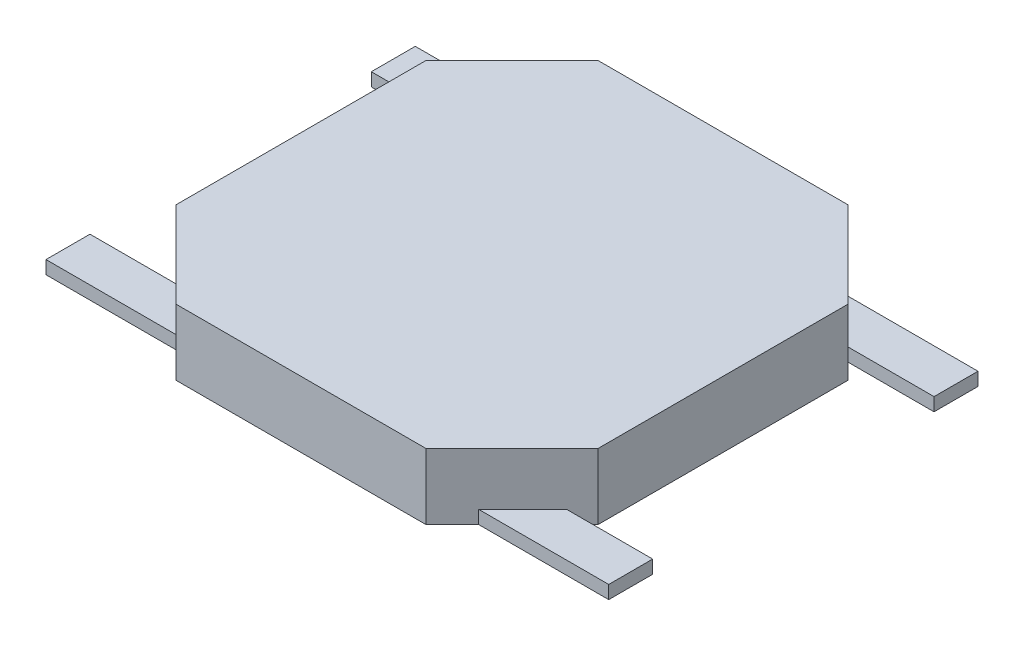
ISO-10303-21;
HEADER;
FILE_DESCRIPTION(('STEP AP214'),'2;1');
FILE_NAME('part.step','',(''),(''),'','','');
FILE_SCHEMA(('AUTOMOTIVE_DESIGN { 1 0 10303 214 1 1 1 1 }'));
ENDSEC;
DATA;
#1=APPLICATION_CONTEXT('core data for automotive mechanical design processes');
#2=APPLICATION_PROTOCOL_DEFINITION('international standard','automotive_design',2000,#1);
#3=PRODUCT_CONTEXT('',#1,'mechanical');
#4=PRODUCT('Part','Part','',(#3));
#5=PRODUCT_RELATED_PRODUCT_CATEGORY('part','',(#4));
#6=PRODUCT_DEFINITION_FORMATION('','',#4);
#7=PRODUCT_DEFINITION_CONTEXT('part definition',#1,'design');
#8=PRODUCT_DEFINITION('design','',#6,#7);
#9=PRODUCT_DEFINITION_SHAPE('','',#8);
#10=(LENGTH_UNIT() NAMED_UNIT(*) SI_UNIT(.MILLI.,.METRE.));
#11=(NAMED_UNIT(*) PLANE_ANGLE_UNIT() SI_UNIT($,.RADIAN.));
#12=(NAMED_UNIT(*) SI_UNIT($,.STERADIAN.) SOLID_ANGLE_UNIT());
#13=UNCERTAINTY_MEASURE_WITH_UNIT(LENGTH_MEASURE(1.E-05),#10,'distance_accuracy_value','');
#14=(GEOMETRIC_REPRESENTATION_CONTEXT(3) GLOBAL_UNCERTAINTY_ASSIGNED_CONTEXT((#13)) GLOBAL_UNIT_ASSIGNED_CONTEXT((#10,
#11,#12)) REPRESENTATION_CONTEXT('',''));
#15=CARTESIAN_POINT('',(0.,0.,0.));
#16=DIRECTION('',(0.,0.,1.));
#17=DIRECTION('',(1.,0.,0.));
#18=AXIS2_PLACEMENT_3D('',#15,#16,#17);
#19=CARTESIAN_POINT('',(2.4,0.75,-1.42));
#20=DIRECTION('',(-1.,0.,0.));
#21=DIRECTION('',(0.,0.,1.));
#22=AXIS2_PLACEMENT_3D('',#19,#20,#21);
#23=PLANE('',#22);
#24=DIRECTION('',(0.,0.,-1.));
#25=VECTOR('',#24,1.);
#26=CARTESIAN_POINT('',(2.4,0.,-1.42));
#27=LINE('',#26,#25);
#28=CARTESIAN_POINT('',(2.4,0.,1.42));
#29=VERTEX_POINT('',#28);
#30=CARTESIAN_POINT('',(2.4,0.,-1.42));
#31=VERTEX_POINT('',#30);
#32=EDGE_CURVE('E302',#29,#31,#27,.T.);
#33=ORIENTED_EDGE('',*,*,#32,.T.);
#34=DIRECTION('',(0.,-1.,0.));
#35=VECTOR('',#34,1.);
#36=CARTESIAN_POINT('',(2.4,0.75,-1.42));
#37=LINE('',#36,#35);
#38=CARTESIAN_POINT('',(2.4,0.75,-1.42));
#39=VERTEX_POINT('',#38);
#40=EDGE_CURVE('E361',#39,#31,#37,.T.);
#41=ORIENTED_EDGE('',*,*,#40,.F.);
#42=DIRECTION('',(0.,0.,-1.));
#43=VECTOR('',#42,1.);
#44=CARTESIAN_POINT('',(2.4,0.75,-1.42));
#45=LINE('',#44,#43);
#46=CARTESIAN_POINT('',(2.4,0.75,1.42));
#47=VERTEX_POINT('',#46);
#48=EDGE_CURVE('E303',#47,#39,#45,.T.);
#49=ORIENTED_EDGE('',*,*,#48,.F.);
#50=DIRECTION('',(0.,-1.,0.));
#51=VECTOR('',#50,1.);
#52=CARTESIAN_POINT('',(2.4,0.75,1.42));
#53=LINE('',#52,#51);
#54=EDGE_CURVE('E321',#47,#29,#53,.T.);
#55=ORIENTED_EDGE('',*,*,#54,.T.);
#56=EDGE_LOOP('',(#33,#41,#49,#55));
#57=FACE_BOUND('',#56,.T.);
#58=ADVANCED_FACE('F35',(#57),#23,.F.);
#59=CARTESIAN_POINT('',(1.42,0.75,-2.4));
#60=DIRECTION('',(-0.707106781186547,0.,0.707106781186547));
#61=DIRECTION('',(0.707106781186548,0.,0.707106781186548));
#62=AXIS2_PLACEMENT_3D('',#59,#60,#61);
#63=PLANE('',#62);
#64=DIRECTION('',(0.707106781186548,0.,0.707106781186548));
#65=VECTOR('',#64,1.);
#66=CARTESIAN_POINT('',(1.42,0.15,-2.4));
#67=LINE('',#66,#65);
#68=CARTESIAN_POINT('',(1.72,0.15,-2.1));
#69=VERTEX_POINT('',#68);
#70=CARTESIAN_POINT('',(2.22,0.15,-1.6));
#71=VERTEX_POINT('',#70);
#72=EDGE_CURVE('E299',#69,#71,#67,.T.);
#73=ORIENTED_EDGE('',*,*,#72,.F.);
#74=DIRECTION('',(0.,-1.,0.));
#75=VECTOR('',#74,1.);
#76=CARTESIAN_POINT('',(1.72,0.75,-2.1));
#77=LINE('',#76,#75);
#78=CARTESIAN_POINT('',(1.72,0.,-2.1));
#79=VERTEX_POINT('',#78);
#80=EDGE_CURVE('E296',#69,#79,#77,.T.);
#81=ORIENTED_EDGE('',*,*,#80,.T.);
#82=DIRECTION('',(-0.707106781186548,0.,-0.707106781186548));
#83=VECTOR('',#82,1.);
#84=CARTESIAN_POINT('',(1.42,0.,-2.4));
#85=LINE('',#84,#83);
#86=CARTESIAN_POINT('',(1.42,0.,-2.4));
#87=VERTEX_POINT('',#86);
#88=EDGE_CURVE('E324',#79,#87,#85,.T.);
#89=ORIENTED_EDGE('',*,*,#88,.T.);
#90=DIRECTION('',(0.,-1.,0.));
#91=VECTOR('',#90,1.);
#92=CARTESIAN_POINT('',(1.42,0.75,-2.4));
#93=LINE('',#92,#91);
#94=CARTESIAN_POINT('',(1.42,0.75,-2.4));
#95=VERTEX_POINT('',#94);
#96=EDGE_CURVE('E358',#95,#87,#93,.T.);
#97=ORIENTED_EDGE('',*,*,#96,.F.);
#98=DIRECTION('',(-0.707106781186548,0.,-0.707106781186548));
#99=VECTOR('',#98,1.);
#100=CARTESIAN_POINT('',(1.42,0.75,-2.4));
#101=LINE('',#100,#99);
#102=EDGE_CURVE('E306',#39,#95,#101,.T.);
#103=ORIENTED_EDGE('',*,*,#102,.F.);
#104=ORIENTED_EDGE('',*,*,#40,.T.);
#105=CARTESIAN_POINT('',(2.22,0.,-1.6));
#106=VERTEX_POINT('',#105);
#107=EDGE_CURVE('E325',#31,#106,#85,.T.);
#108=ORIENTED_EDGE('',*,*,#107,.T.);
#109=DIRECTION('',(0.,1.,0.));
#110=VECTOR('',#109,1.);
#111=CARTESIAN_POINT('',(2.22,0.75,-1.6));
#112=LINE('',#111,#110);
#113=EDGE_CURVE('E292',#106,#71,#112,.T.);
#114=ORIENTED_EDGE('',*,*,#113,.T.);
#115=EDGE_LOOP('',(#73,#81,#89,#97,#103,#104,#108,#114));
#116=FACE_BOUND('',#115,.T.);
#117=ADVANCED_FACE('F408',(#116),#63,.F.);
#118=CARTESIAN_POINT('',(-1.42,0.75,-2.4));
#119=DIRECTION('',(0.,0.,1.));
#120=DIRECTION('',(1.,0.,0.));
#121=AXIS2_PLACEMENT_3D('',#118,#119,#120);
#122=PLANE('',#121);
#123=DIRECTION('',(-1.,0.,0.));
#124=VECTOR('',#123,1.);
#125=CARTESIAN_POINT('',(-1.42,0.,-2.4));
#126=LINE('',#125,#124);
#127=CARTESIAN_POINT('',(-1.42,0.,-2.4));
#128=VERTEX_POINT('',#127);
#129=EDGE_CURVE('E327',#87,#128,#126,.T.);
#130=ORIENTED_EDGE('',*,*,#129,.T.);
#131=DIRECTION('',(0.,-1.,0.));
#132=VECTOR('',#131,1.);
#133=CARTESIAN_POINT('',(-1.42,0.75,-2.4));
#134=LINE('',#133,#132);
#135=CARTESIAN_POINT('',(-1.42,0.75,-2.4));
#136=VERTEX_POINT('',#135);
#137=EDGE_CURVE('E355',#136,#128,#134,.T.);
#138=ORIENTED_EDGE('',*,*,#137,.F.);
#139=DIRECTION('',(-1.,0.,0.));
#140=VECTOR('',#139,1.);
#141=CARTESIAN_POINT('',(-1.42,0.75,-2.4));
#142=LINE('',#141,#140);
#143=EDGE_CURVE('E309',#95,#136,#142,.T.);
#144=ORIENTED_EDGE('',*,*,#143,.F.);
#145=ORIENTED_EDGE('',*,*,#96,.T.);
#146=EDGE_LOOP('',(#130,#138,#144,#145));
#147=FACE_BOUND('',#146,.T.);
#148=ADVANCED_FACE('F405',(#147),#122,.F.);
#149=CARTESIAN_POINT('',(-2.4,0.75,-1.42));
#150=DIRECTION('',(0.707106781186547,0.,0.707106781186547));
#151=DIRECTION('',(0.707106781186548,0.,-0.707106781186548));
#152=AXIS2_PLACEMENT_3D('',#149,#150,#151);
#153=PLANE('',#152);
#154=DIRECTION('',(-0.707106781186548,0.,0.707106781186548));
#155=VECTOR('',#154,1.);
#156=CARTESIAN_POINT('',(-2.4,0.,-1.42));
#157=LINE('',#156,#155);
#158=CARTESIAN_POINT('',(-1.72,0.,-2.1));
#159=VERTEX_POINT('',#158);
#160=EDGE_CURVE('E330',#128,#159,#157,.T.);
#161=ORIENTED_EDGE('',*,*,#160,.T.);
#162=DIRECTION('',(0.,1.,0.));
#163=VECTOR('',#162,1.);
#164=CARTESIAN_POINT('',(-1.72,0.75,-2.1));
#165=LINE('',#164,#163);
#166=CARTESIAN_POINT('',(-1.72,0.15,-2.1));
#167=VERTEX_POINT('',#166);
#168=EDGE_CURVE('E294',#159,#167,#165,.T.);
#169=ORIENTED_EDGE('',*,*,#168,.T.);
#170=DIRECTION('',(0.707106781186548,0.,-0.707106781186548));
#171=VECTOR('',#170,1.);
#172=CARTESIAN_POINT('',(-2.4,0.15,-1.42));
#173=LINE('',#172,#171);
#174=CARTESIAN_POINT('',(-2.22,0.15,-1.6));
#175=VERTEX_POINT('',#174);
#176=EDGE_CURVE('E42',#175,#167,#173,.T.);
#177=ORIENTED_EDGE('',*,*,#176,.F.);
#178=DIRECTION('',(0.,-1.,0.));
#179=VECTOR('',#178,1.);
#180=CARTESIAN_POINT('',(-2.22,0.75,-1.6));
#181=LINE('',#180,#179);
#182=CARTESIAN_POINT('',(-2.22,0.,-1.6));
#183=VERTEX_POINT('',#182);
#184=EDGE_CURVE('E283',#175,#183,#181,.T.);
#185=ORIENTED_EDGE('',*,*,#184,.T.);
#186=CARTESIAN_POINT('',(-2.4,0.,-1.42));
#187=VERTEX_POINT('',#186);
#188=EDGE_CURVE('E329',#183,#187,#157,.T.);
#189=ORIENTED_EDGE('',*,*,#188,.T.);
#190=DIRECTION('',(0.,-1.,0.));
#191=VECTOR('',#190,1.);
#192=CARTESIAN_POINT('',(-2.4,0.75,-1.42));
#193=LINE('',#192,#191);
#194=CARTESIAN_POINT('',(-2.4,0.75,-1.42));
#195=VERTEX_POINT('',#194);
#196=EDGE_CURVE('E352',#195,#187,#193,.T.);
#197=ORIENTED_EDGE('',*,*,#196,.F.);
#198=DIRECTION('',(-0.707106781186548,0.,0.707106781186548));
#199=VECTOR('',#198,1.);
#200=CARTESIAN_POINT('',(-2.4,0.75,-1.42));
#201=LINE('',#200,#199);
#202=EDGE_CURVE('E311',#136,#195,#201,.T.);
#203=ORIENTED_EDGE('',*,*,#202,.F.);
#204=ORIENTED_EDGE('',*,*,#137,.T.);
#205=EDGE_LOOP('',(#161,#169,#177,#185,#189,#197,#203,#204));
#206=FACE_BOUND('',#205,.T.);
#207=ADVANCED_FACE('F382',(#206),#153,.F.);
#208=CARTESIAN_POINT('',(-2.4,0.75,1.42));
#209=DIRECTION('',(1.,0.,0.));
#210=DIRECTION('',(0.,0.,-1.));
#211=AXIS2_PLACEMENT_3D('',#208,#209,#210);
#212=PLANE('',#211);
#213=DIRECTION('',(0.,0.,1.));
#214=VECTOR('',#213,1.);
#215=CARTESIAN_POINT('',(-2.4,0.,1.42));
#216=LINE('',#215,#214);
#217=CARTESIAN_POINT('',(-2.4,0.,1.42));
#218=VERTEX_POINT('',#217);
#219=EDGE_CURVE('E332',#187,#218,#216,.T.);
#220=ORIENTED_EDGE('',*,*,#219,.T.);
#221=DIRECTION('',(0.,-1.,0.));
#222=VECTOR('',#221,1.);
#223=CARTESIAN_POINT('',(-2.4,0.75,1.42));
#224=LINE('',#223,#222);
#225=CARTESIAN_POINT('',(-2.4,0.75,1.42));
#226=VERTEX_POINT('',#225);
#227=EDGE_CURVE('E349',#226,#218,#224,.T.);
#228=ORIENTED_EDGE('',*,*,#227,.F.);
#229=DIRECTION('',(0.,0.,1.));
#230=VECTOR('',#229,1.);
#231=CARTESIAN_POINT('',(-2.4,0.75,1.42));
#232=LINE('',#231,#230);
#233=EDGE_CURVE('E313',#195,#226,#232,.T.);
#234=ORIENTED_EDGE('',*,*,#233,.F.);
#235=ORIENTED_EDGE('',*,*,#196,.T.);
#236=EDGE_LOOP('',(#220,#228,#234,#235));
#237=FACE_BOUND('',#236,.T.);
#238=ADVANCED_FACE('F389',(#237),#212,.F.);
#239=CARTESIAN_POINT('',(-1.42,0.75,2.4));
#240=DIRECTION('',(0.707106781186547,0.,-0.707106781186548));
#241=DIRECTION('',(-0.707106781186548,0.,-0.707106781186547));
#242=AXIS2_PLACEMENT_3D('',#239,#240,#241);
#243=PLANE('',#242);
#244=DIRECTION('',(-0.707106781186548,0.,-0.707106781186547));
#245=VECTOR('',#244,1.);
#246=CARTESIAN_POINT('',(-1.42,0.15,2.4));
#247=LINE('',#246,#245);
#248=CARTESIAN_POINT('',(-1.71999999999997,0.15,2.10000000000003));
#249=VERTEX_POINT('',#248);
#250=CARTESIAN_POINT('',(-2.22000000000003,0.15,1.59999999999997));
#251=VERTEX_POINT('',#250);
#252=EDGE_CURVE('E53',#249,#251,#247,.T.);
#253=ORIENTED_EDGE('',*,*,#252,.F.);
#254=DIRECTION('',(0.,-1.,0.));
#255=VECTOR('',#254,1.);
#256=CARTESIAN_POINT('',(-1.71999999999998,0.75,2.10000000000002));
#257=LINE('',#256,#255);
#258=CARTESIAN_POINT('',(-1.71999999999998,0.,2.10000000000002));
#259=VERTEX_POINT('',#258);
#260=EDGE_CURVE('E248',#249,#259,#257,.T.);
#261=ORIENTED_EDGE('',*,*,#260,.T.);
#262=DIRECTION('',(0.707106781186548,0.,0.707106781186547));
#263=VECTOR('',#262,1.);
#264=CARTESIAN_POINT('',(-1.42,0.,2.4));
#265=LINE('',#264,#263);
#266=CARTESIAN_POINT('',(-1.42,0.,2.4));
#267=VERTEX_POINT('',#266);
#268=EDGE_CURVE('E334',#259,#267,#265,.T.);
#269=ORIENTED_EDGE('',*,*,#268,.T.);
#270=DIRECTION('',(0.,-1.,0.));
#271=VECTOR('',#270,1.);
#272=CARTESIAN_POINT('',(-1.42,0.75,2.4));
#273=LINE('',#272,#271);
#274=CARTESIAN_POINT('',(-1.42,0.75,2.4));
#275=VERTEX_POINT('',#274);
#276=EDGE_CURVE('E346',#275,#267,#273,.T.);
#277=ORIENTED_EDGE('',*,*,#276,.F.);
#278=DIRECTION('',(0.707106781186548,0.,0.707106781186547));
#279=VECTOR('',#278,1.);
#280=CARTESIAN_POINT('',(-1.42,0.75,2.4));
#281=LINE('',#280,#279);
#282=EDGE_CURVE('E315',#226,#275,#281,.T.);
#283=ORIENTED_EDGE('',*,*,#282,.F.);
#284=ORIENTED_EDGE('',*,*,#227,.T.);
#285=CARTESIAN_POINT('',(-2.21999999999998,0.,1.60000000000002));
#286=VERTEX_POINT('',#285);
#287=EDGE_CURVE('E335',#218,#286,#265,.T.);
#288=ORIENTED_EDGE('',*,*,#287,.T.);
#289=DIRECTION('',(0.,1.,0.));
#290=VECTOR('',#289,1.);
#291=CARTESIAN_POINT('',(-2.21999999999998,0.75,1.60000000000002));
#292=LINE('',#291,#290);
#293=EDGE_CURVE('E49',#286,#251,#292,.T.);
#294=ORIENTED_EDGE('',*,*,#293,.T.);
#295=EDGE_LOOP('',(#253,#261,#269,#277,#283,#284,#288,#294));
#296=FACE_BOUND('',#295,.T.);
#297=ADVANCED_FACE('F393',(#296),#243,.F.);
#298=CARTESIAN_POINT('',(1.42,0.75,2.4));
#299=DIRECTION('',(0.,0.,-1.));
#300=DIRECTION('',(-1.,0.,0.));
#301=AXIS2_PLACEMENT_3D('',#298,#299,#300);
#302=PLANE('',#301);
#303=DIRECTION('',(1.,0.,0.));
#304=VECTOR('',#303,1.);
#305=CARTESIAN_POINT('',(1.42,0.,2.4));
#306=LINE('',#305,#304);
#307=CARTESIAN_POINT('',(1.42,0.,2.4));
#308=VERTEX_POINT('',#307);
#309=EDGE_CURVE('E337',#267,#308,#306,.T.);
#310=ORIENTED_EDGE('',*,*,#309,.T.);
#311=DIRECTION('',(0.,-1.,0.));
#312=VECTOR('',#311,1.);
#313=CARTESIAN_POINT('',(1.42,0.75,2.4));
#314=LINE('',#313,#312);
#315=CARTESIAN_POINT('',(1.42,0.75,2.4));
#316=VERTEX_POINT('',#315);
#317=EDGE_CURVE('E343',#316,#308,#314,.T.);
#318=ORIENTED_EDGE('',*,*,#317,.F.);
#319=DIRECTION('',(1.,0.,0.));
#320=VECTOR('',#319,1.);
#321=CARTESIAN_POINT('',(1.42,0.75,2.4));
#322=LINE('',#321,#320);
#323=EDGE_CURVE('E317',#275,#316,#322,.T.);
#324=ORIENTED_EDGE('',*,*,#323,.F.);
#325=ORIENTED_EDGE('',*,*,#276,.T.);
#326=EDGE_LOOP('',(#310,#318,#324,#325));
#327=FACE_BOUND('',#326,.T.);
#328=ADVANCED_FACE('F590',(#327),#302,.F.);
#329=CARTESIAN_POINT('',(2.4,0.75,1.42));
#330=DIRECTION('',(-0.707106781186548,0.,-0.707106781186547));
#331=DIRECTION('',(-0.707106781186547,0.,0.707106781186548));
#332=AXIS2_PLACEMENT_3D('',#329,#330,#331);
#333=PLANE('',#332);
#334=DIRECTION('',(0.707106781186547,0.,-0.707106781186548));
#335=VECTOR('',#334,1.);
#336=CARTESIAN_POINT('',(2.4,0.,1.42));
#337=LINE('',#336,#335);
#338=CARTESIAN_POINT('',(1.72000000000001,0.,2.09999999999998));
#339=VERTEX_POINT('',#338);
#340=EDGE_CURVE('E307',#308,#339,#337,.T.);
#341=ORIENTED_EDGE('',*,*,#340,.T.);
#342=DIRECTION('',(0.,1.,0.));
#343=VECTOR('',#342,1.);
#344=CARTESIAN_POINT('',(1.72000000000001,0.75,2.09999999999998));
#345=LINE('',#344,#343);
#346=CARTESIAN_POINT('',(1.71999999999997,0.15,2.10000000000003));
#347=VERTEX_POINT('',#346);
#348=EDGE_CURVE('E246',#339,#347,#345,.T.);
#349=ORIENTED_EDGE('',*,*,#348,.T.);
#350=DIRECTION('',(-0.707106781186547,0.,0.707106781186548));
#351=VECTOR('',#350,1.);
#352=CARTESIAN_POINT('',(2.4,0.15,1.42));
#353=LINE('',#352,#351);
#354=CARTESIAN_POINT('',(2.22000000000003,0.15,1.59999999999997));
#355=VERTEX_POINT('',#354);
#356=EDGE_CURVE('E11',#355,#347,#353,.T.);
#357=ORIENTED_EDGE('',*,*,#356,.F.);
#358=DIRECTION('',(0.,-1.,0.));
#359=VECTOR('',#358,1.);
#360=CARTESIAN_POINT('',(2.22000000000002,0.75,1.59999999999998));
#361=LINE('',#360,#359);
#362=CARTESIAN_POINT('',(2.22000000000002,0.,1.59999999999998));
#363=VERTEX_POINT('',#362);
#364=EDGE_CURVE('E238',#355,#363,#361,.T.);
#365=ORIENTED_EDGE('',*,*,#364,.T.);
#366=EDGE_CURVE('E339',#363,#29,#337,.T.);
#367=ORIENTED_EDGE('',*,*,#366,.T.);
#368=ORIENTED_EDGE('',*,*,#54,.F.);
#369=DIRECTION('',(0.707106781186547,0.,-0.707106781186548));
#370=VECTOR('',#369,1.);
#371=CARTESIAN_POINT('',(2.4,0.75,1.42));
#372=LINE('',#371,#370);
#373=EDGE_CURVE('E319',#316,#47,#372,.T.);
#374=ORIENTED_EDGE('',*,*,#373,.F.);
#375=ORIENTED_EDGE('',*,*,#317,.T.);
#376=EDGE_LOOP('',(#341,#349,#357,#365,#367,#368,#374,#375));
#377=FACE_BOUND('',#376,.T.);
#378=ADVANCED_FACE('F447',(#377),#333,.F.);
#379=CARTESIAN_POINT('',(0.,0.75,0.));
#380=DIRECTION('',(0.,-1.,0.));
#381=DIRECTION('',(0.,0.,-1.));
#382=AXIS2_PLACEMENT_3D('',#379,#380,#381);
#383=PLANE('',#382);
#384=ORIENTED_EDGE('',*,*,#48,.T.);
#385=ORIENTED_EDGE('',*,*,#102,.T.);
#386=ORIENTED_EDGE('',*,*,#143,.T.);
#387=ORIENTED_EDGE('',*,*,#202,.T.);
#388=ORIENTED_EDGE('',*,*,#233,.T.);
#389=ORIENTED_EDGE('',*,*,#282,.T.);
#390=ORIENTED_EDGE('',*,*,#323,.T.);
#391=ORIENTED_EDGE('',*,*,#373,.T.);
#392=EDGE_LOOP('',(#384,#385,#386,#387,#388,#389,#390,#391));
#393=FACE_BOUND('',#392,.T.);
#394=ADVANCED_FACE('F398',(#393),#383,.F.);
#395=CARTESIAN_POINT('',(0.,0.,0.));
#396=DIRECTION('',(0.,-1.,0.));
#397=DIRECTION('',(0.,0.,-1.));
#398=AXIS2_PLACEMENT_3D('',#395,#396,#397);
#399=PLANE('',#398);
#400=ORIENTED_EDGE('',*,*,#366,.F.);
#401=DIRECTION('',(1.,0.,0.));
#402=VECTOR('',#401,1.);
#403=CARTESIAN_POINT('',(3.20000000000001,0.,1.59999999999997));
#404=LINE('',#403,#402);
#405=CARTESIAN_POINT('',(3.20000000000001,0.,1.59999999999997));
#406=VERTEX_POINT('',#405);
#407=EDGE_CURVE('E232',#363,#406,#404,.T.);
#408=ORIENTED_EDGE('',*,*,#407,.T.);
#409=DIRECTION('',(0.,0.,1.));
#410=VECTOR('',#409,1.);
#411=CARTESIAN_POINT('',(3.20000000000001,0.,1.59999999999997));
#412=LINE('',#411,#410);
#413=CARTESIAN_POINT('',(3.20000000000002,0.,2.09999999999997));
#414=VERTEX_POINT('',#413);
#415=EDGE_CURVE('E234',#406,#414,#412,.T.);
#416=ORIENTED_EDGE('',*,*,#415,.T.);
#417=DIRECTION('',(-1.,0.,0.));
#418=VECTOR('',#417,1.);
#419=CARTESIAN_POINT('',(3.20000000000002,0.,2.09999999999997));
#420=LINE('',#419,#418);
#421=EDGE_CURVE('E219',#414,#339,#420,.T.);
#422=ORIENTED_EDGE('',*,*,#421,.T.);
#423=ORIENTED_EDGE('',*,*,#340,.F.);
#424=ORIENTED_EDGE('',*,*,#309,.F.);
#425=ORIENTED_EDGE('',*,*,#268,.F.);
#426=CARTESIAN_POINT('',(-3.19999999999998,0.,2.10000000000003));
#427=VERTEX_POINT('',#426);
#428=EDGE_CURVE('E222',#259,#427,#420,.T.);
#429=ORIENTED_EDGE('',*,*,#428,.T.);
#430=DIRECTION('',(0.,0.,-1.));
#431=VECTOR('',#430,1.);
#432=CARTESIAN_POINT('',(-3.19999999999999,0.,1.60000000000003));
#433=LINE('',#432,#431);
#434=CARTESIAN_POINT('',(-3.19999999999999,0.,1.60000000000003));
#435=VERTEX_POINT('',#434);
#436=EDGE_CURVE('E230',#427,#435,#433,.T.);
#437=ORIENTED_EDGE('',*,*,#436,.T.);
#438=EDGE_CURVE('E199',#435,#286,#404,.T.);
#439=ORIENTED_EDGE('',*,*,#438,.T.);
#440=ORIENTED_EDGE('',*,*,#287,.F.);
#441=ORIENTED_EDGE('',*,*,#219,.F.);
#442=ORIENTED_EDGE('',*,*,#188,.F.);
#443=DIRECTION('',(-1.,0.,0.));
#444=VECTOR('',#443,1.);
#445=CARTESIAN_POINT('',(-3.2,0.,-1.6));
#446=LINE('',#445,#444);
#447=CARTESIAN_POINT('',(-3.2,0.,-1.6));
#448=VERTEX_POINT('',#447);
#449=EDGE_CURVE('E270',#183,#448,#446,.T.);
#450=ORIENTED_EDGE('',*,*,#449,.T.);
#451=DIRECTION('',(0.,0.,-1.));
#452=VECTOR('',#451,1.);
#453=CARTESIAN_POINT('',(-3.2,0.,-1.6));
#454=LINE('',#453,#452);
#455=CARTESIAN_POINT('',(-3.2,0.,-2.1));
#456=VERTEX_POINT('',#455);
#457=EDGE_CURVE('E274',#448,#456,#454,.T.);
#458=ORIENTED_EDGE('',*,*,#457,.T.);
#459=DIRECTION('',(1.,0.,0.));
#460=VECTOR('',#459,1.);
#461=CARTESIAN_POINT('',(-3.2,0.,-2.1));
#462=LINE('',#461,#460);
#463=EDGE_CURVE('E256',#456,#159,#462,.T.);
#464=ORIENTED_EDGE('',*,*,#463,.T.);
#465=ORIENTED_EDGE('',*,*,#160,.F.);
#466=ORIENTED_EDGE('',*,*,#129,.F.);
#467=ORIENTED_EDGE('',*,*,#88,.F.);
#468=CARTESIAN_POINT('',(3.2,0.,-2.1));
#469=VERTEX_POINT('',#468);
#470=EDGE_CURVE('E277',#79,#469,#462,.T.);
#471=ORIENTED_EDGE('',*,*,#470,.T.);
#472=DIRECTION('',(0.,0.,1.));
#473=VECTOR('',#472,1.);
#474=CARTESIAN_POINT('',(3.2,0.,-1.6));
#475=LINE('',#474,#473);
#476=CARTESIAN_POINT('',(3.2,0.,-1.6));
#477=VERTEX_POINT('',#476);
#478=EDGE_CURVE('E251',#469,#477,#475,.T.);
#479=ORIENTED_EDGE('',*,*,#478,.T.);
#480=EDGE_CURVE('E271',#477,#106,#446,.T.);
#481=ORIENTED_EDGE('',*,*,#480,.T.);
#482=ORIENTED_EDGE('',*,*,#107,.F.);
#483=ORIENTED_EDGE('',*,*,#32,.F.);
#484=EDGE_LOOP('',(#400,#408,#416,#422,#423,#424,#425,#429,#437,#439,#440,#441,#442,#450,#458,
#464,#465,#466,#467,#471,#479,#481,#482,#483));
#485=FACE_BOUND('',#484,.T.);
#486=ADVANCED_FACE('F392',(#485),#399,.T.);
#487=CARTESIAN_POINT('',(-3.2,0.15,-1.6));
#488=DIRECTION('',(-1.,0.,0.));
#489=DIRECTION('',(0.,0.,1.));
#490=AXIS2_PLACEMENT_3D('',#487,#488,#489);
#491=PLANE('',#490);
#492=ORIENTED_EDGE('',*,*,#457,.F.);
#493=DIRECTION('',(0.,-1.,0.));
#494=VECTOR('',#493,1.);
#495=CARTESIAN_POINT('',(-3.2,0.15,-1.6));
#496=LINE('',#495,#494);
#497=CARTESIAN_POINT('',(-3.2,0.15,-1.6));
#498=VERTEX_POINT('',#497);
#499=EDGE_CURVE('E286',#498,#448,#496,.T.);
#500=ORIENTED_EDGE('',*,*,#499,.F.);
#501=DIRECTION('',(0.,0.,-1.));
#502=VECTOR('',#501,1.);
#503=CARTESIAN_POINT('',(-3.2,0.15,-1.6));
#504=LINE('',#503,#502);
#505=CARTESIAN_POINT('',(-3.2,0.15,-2.1));
#506=VERTEX_POINT('',#505);
#507=EDGE_CURVE('E260',#498,#506,#504,.T.);
#508=ORIENTED_EDGE('',*,*,#507,.T.);
#509=DIRECTION('',(0.,-1.,0.));
#510=VECTOR('',#509,1.);
#511=CARTESIAN_POINT('',(-3.2,0.15,-2.1));
#512=LINE('',#511,#510);
#513=EDGE_CURVE('E284',#506,#456,#512,.T.);
#514=ORIENTED_EDGE('',*,*,#513,.T.);
#515=EDGE_LOOP('',(#492,#500,#508,#514));
#516=FACE_BOUND('',#515,.T.);
#517=ADVANCED_FACE('F378',(#516),#491,.T.);
#518=CARTESIAN_POINT('',(0.,0.15,0.));
#519=DIRECTION('',(0.,-1.,0.));
#520=DIRECTION('',(0.,0.,-1.));
#521=AXIS2_PLACEMENT_3D('',#518,#519,#520);
#522=PLANE('',#521);
#523=DIRECTION('',(-1.,0.,0.));
#524=VECTOR('',#523,1.);
#525=CARTESIAN_POINT('',(-3.2,0.15,-1.6));
#526=LINE('',#525,#524);
#527=EDGE_CURVE('E255',#175,#498,#526,.T.);
#528=ORIENTED_EDGE('',*,*,#527,.F.);
#529=ORIENTED_EDGE('',*,*,#176,.T.);
#530=DIRECTION('',(1.,0.,0.));
#531=VECTOR('',#530,1.);
#532=CARTESIAN_POINT('',(-3.2,0.15,-2.1));
#533=LINE('',#532,#531);
#534=EDGE_CURVE('E264',#506,#167,#533,.T.);
#535=ORIENTED_EDGE('',*,*,#534,.F.);
#536=ORIENTED_EDGE('',*,*,#507,.F.);
#537=EDGE_LOOP('',(#528,#529,#535,#536));
#538=FACE_BOUND('',#537,.T.);
#539=ADVANCED_FACE('F367',(#538),#522,.F.);
#540=CARTESIAN_POINT('',(-3.2,0.15,-1.6));
#541=DIRECTION('',(0.,0.,1.));
#542=DIRECTION('',(1.,0.,0.));
#543=AXIS2_PLACEMENT_3D('',#540,#541,#542);
#544=PLANE('',#543);
#545=ORIENTED_EDGE('',*,*,#184,.F.);
#546=ORIENTED_EDGE('',*,*,#527,.T.);
#547=ORIENTED_EDGE('',*,*,#499,.T.);
#548=ORIENTED_EDGE('',*,*,#449,.F.);
#549=EDGE_LOOP('',(#545,#546,#547,#548));
#550=FACE_BOUND('',#549,.T.);
#551=ADVANCED_FACE('F381',(#550),#544,.T.);
#552=CARTESIAN_POINT('',(-3.2,0.15,-2.1));
#553=DIRECTION('',(0.,0.,-1.));
#554=DIRECTION('',(-1.,0.,0.));
#555=AXIS2_PLACEMENT_3D('',#552,#553,#554);
#556=PLANE('',#555);
#557=ORIENTED_EDGE('',*,*,#168,.F.);
#558=ORIENTED_EDGE('',*,*,#463,.F.);
#559=ORIENTED_EDGE('',*,*,#513,.F.);
#560=ORIENTED_EDGE('',*,*,#534,.T.);
#561=EDGE_LOOP('',(#557,#558,#559,#560));
#562=FACE_BOUND('',#561,.T.);
#563=ADVANCED_FACE('F373',(#562),#556,.T.);
#564=CARTESIAN_POINT('',(3.2,0.15,-2.1));
#565=VERTEX_POINT('',#564);
#566=EDGE_CURVE('E263',#69,#565,#533,.T.);
#567=ORIENTED_EDGE('',*,*,#566,.F.);
#568=ORIENTED_EDGE('',*,*,#72,.T.);
#569=CARTESIAN_POINT('',(3.2,0.15,-1.6));
#570=VERTEX_POINT('',#569);
#571=EDGE_CURVE('E257',#570,#71,#526,.T.);
#572=ORIENTED_EDGE('',*,*,#571,.F.);
#573=DIRECTION('',(0.,0.,1.));
#574=VECTOR('',#573,1.);
#575=CARTESIAN_POINT('',(3.2,0.15,-1.6));
#576=LINE('',#575,#574);
#577=EDGE_CURVE('E252',#565,#570,#576,.T.);
#578=ORIENTED_EDGE('',*,*,#577,.F.);
#579=EDGE_LOOP('',(#567,#568,#572,#578));
#580=FACE_BOUND('',#579,.T.);
#581=ADVANCED_FACE('F425',(#580),#522,.F.);
#582=ORIENTED_EDGE('',*,*,#80,.F.);
#583=ORIENTED_EDGE('',*,*,#566,.T.);
#584=DIRECTION('',(0.,-1.,0.));
#585=VECTOR('',#584,1.);
#586=CARTESIAN_POINT('',(3.2,0.15,-2.1));
#587=LINE('',#586,#585);
#588=EDGE_CURVE('E280',#565,#469,#587,.T.);
#589=ORIENTED_EDGE('',*,*,#588,.T.);
#590=ORIENTED_EDGE('',*,*,#470,.F.);
#591=EDGE_LOOP('',(#582,#583,#589,#590));
#592=FACE_BOUND('',#591,.T.);
#593=ADVANCED_FACE('F413',(#592),#556,.T.);
#594=ORIENTED_EDGE('',*,*,#113,.F.);
#595=ORIENTED_EDGE('',*,*,#480,.F.);
#596=DIRECTION('',(0.,-1.,0.));
#597=VECTOR('',#596,1.);
#598=CARTESIAN_POINT('',(3.2,0.15,-1.6));
#599=LINE('',#598,#597);
#600=EDGE_CURVE('E267',#570,#477,#599,.T.);
#601=ORIENTED_EDGE('',*,*,#600,.F.);
#602=ORIENTED_EDGE('',*,*,#571,.T.);
#603=EDGE_LOOP('',(#594,#595,#601,#602));
#604=FACE_BOUND('',#603,.T.);
#605=ADVANCED_FACE('F423',(#604),#544,.T.);
#606=CARTESIAN_POINT('',(3.2,0.15,-1.6));
#607=DIRECTION('',(1.,0.,0.));
#608=DIRECTION('',(0.,0.,-1.));
#609=AXIS2_PLACEMENT_3D('',#606,#607,#608);
#610=PLANE('',#609);
#611=ORIENTED_EDGE('',*,*,#478,.F.);
#612=ORIENTED_EDGE('',*,*,#588,.F.);
#613=ORIENTED_EDGE('',*,*,#577,.T.);
#614=ORIENTED_EDGE('',*,*,#600,.T.);
#615=EDGE_LOOP('',(#611,#612,#613,#614));
#616=FACE_BOUND('',#615,.T.);
#617=ADVANCED_FACE('F418',(#616),#610,.T.);
#618=CARTESIAN_POINT('',(3.20000000000001,0.15,1.59999999999997));
#619=DIRECTION('',(1.,0.,0.));
#620=DIRECTION('',(0.,0.,-1.));
#621=AXIS2_PLACEMENT_3D('',#618,#619,#620);
#622=PLANE('',#621);
#623=ORIENTED_EDGE('',*,*,#415,.F.);
#624=DIRECTION('',(0.,-1.,0.));
#625=VECTOR('',#624,1.);
#626=CARTESIAN_POINT('',(3.20000000000001,0.15,1.59999999999997));
#627=LINE('',#626,#625);
#628=CARTESIAN_POINT('',(3.20000000000001,0.15,1.59999999999997));
#629=VERTEX_POINT('',#628);
#630=EDGE_CURVE('E204',#629,#406,#627,.T.);
#631=ORIENTED_EDGE('',*,*,#630,.F.);
#632=DIRECTION('',(0.,0.,1.));
#633=VECTOR('',#632,1.);
#634=CARTESIAN_POINT('',(3.20000000000001,0.15,1.59999999999997));
#635=LINE('',#634,#633);
#636=CARTESIAN_POINT('',(3.20000000000002,0.15,2.09999999999997));
#637=VERTEX_POINT('',#636);
#638=EDGE_CURVE('E212',#629,#637,#635,.T.);
#639=ORIENTED_EDGE('',*,*,#638,.T.);
#640=DIRECTION('',(0.,-1.,0.));
#641=VECTOR('',#640,1.);
#642=CARTESIAN_POINT('',(3.20000000000002,0.15,2.09999999999997));
#643=LINE('',#642,#641);
#644=EDGE_CURVE('E239',#637,#414,#643,.T.);
#645=ORIENTED_EDGE('',*,*,#644,.T.);
#646=EDGE_LOOP('',(#623,#631,#639,#645));
#647=FACE_BOUND('',#646,.T.);
#648=ADVANCED_FACE('F455',(#647),#622,.T.);
#649=CARTESIAN_POINT('',(0.,0.15,0.));
#650=DIRECTION('',(0.,-1.,0.));
#651=DIRECTION('',(0.,0.,-1.));
#652=AXIS2_PLACEMENT_3D('',#649,#650,#651);
#653=PLANE('',#652);
#654=DIRECTION('',(1.,0.,0.));
#655=VECTOR('',#654,1.);
#656=CARTESIAN_POINT('',(3.20000000000001,0.15,1.59999999999997));
#657=LINE('',#656,#655);
#658=EDGE_CURVE('E213',#355,#629,#657,.T.);
#659=ORIENTED_EDGE('',*,*,#658,.F.);
#660=ORIENTED_EDGE('',*,*,#356,.T.);
#661=DIRECTION('',(-1.,0.,0.));
#662=VECTOR('',#661,1.);
#663=CARTESIAN_POINT('',(3.20000000000002,0.15,2.09999999999997));
#664=LINE('',#663,#662);
#665=EDGE_CURVE('E205',#637,#347,#664,.T.);
#666=ORIENTED_EDGE('',*,*,#665,.F.);
#667=ORIENTED_EDGE('',*,*,#638,.F.);
#668=EDGE_LOOP('',(#659,#660,#666,#667));
#669=FACE_BOUND('',#668,.T.);
#670=ADVANCED_FACE('F463',(#669),#653,.F.);
#671=CARTESIAN_POINT('',(3.20000000000001,0.15,1.59999999999997));
#672=DIRECTION('',(0.,0.,-1.));
#673=DIRECTION('',(-1.,0.,0.));
#674=AXIS2_PLACEMENT_3D('',#671,#672,#673);
#675=PLANE('',#674);
#676=ORIENTED_EDGE('',*,*,#364,.F.);
#677=ORIENTED_EDGE('',*,*,#658,.T.);
#678=ORIENTED_EDGE('',*,*,#630,.T.);
#679=ORIENTED_EDGE('',*,*,#407,.F.);
#680=EDGE_LOOP('',(#676,#677,#678,#679));
#681=FACE_BOUND('',#680,.T.);
#682=ADVANCED_FACE('F450',(#681),#675,.T.);
#683=CARTESIAN_POINT('',(3.20000000000002,0.15,2.09999999999997));
#684=DIRECTION('',(0.,0.,1.));
#685=DIRECTION('',(1.,0.,0.));
#686=AXIS2_PLACEMENT_3D('',#683,#684,#685);
#687=PLANE('',#686);
#688=ORIENTED_EDGE('',*,*,#348,.F.);
#689=ORIENTED_EDGE('',*,*,#421,.F.);
#690=ORIENTED_EDGE('',*,*,#644,.F.);
#691=ORIENTED_EDGE('',*,*,#665,.T.);
#692=EDGE_LOOP('',(#688,#689,#690,#691));
#693=FACE_BOUND('',#692,.T.);
#694=ADVANCED_FACE('F460',(#693),#687,.T.);
#695=CARTESIAN_POINT('',(-3.19999999999998,0.15,2.10000000000003));
#696=VERTEX_POINT('',#695);
#697=EDGE_CURVE('E227',#249,#696,#664,.T.);
#698=ORIENTED_EDGE('',*,*,#697,.F.);
#699=ORIENTED_EDGE('',*,*,#252,.T.);
#700=CARTESIAN_POINT('',(-3.19999999999999,0.15,1.60000000000003));
#701=VERTEX_POINT('',#700);
#702=EDGE_CURVE('E197',#701,#251,#657,.T.);
#703=ORIENTED_EDGE('',*,*,#702,.F.);
#704=DIRECTION('',(0.,0.,-1.));
#705=VECTOR('',#704,1.);
#706=CARTESIAN_POINT('',(-3.19999999999999,0.15,1.60000000000003));
#707=LINE('',#706,#705);
#708=EDGE_CURVE('E211',#696,#701,#707,.T.);
#709=ORIENTED_EDGE('',*,*,#708,.F.);
#710=EDGE_LOOP('',(#698,#699,#703,#709));
#711=FACE_BOUND('',#710,.T.);
#712=ADVANCED_FACE('F210',(#711),#653,.F.);
#713=ORIENTED_EDGE('',*,*,#260,.F.);
#714=ORIENTED_EDGE('',*,*,#697,.T.);
#715=DIRECTION('',(0.,-1.,0.));
#716=VECTOR('',#715,1.);
#717=CARTESIAN_POINT('',(-3.19999999999998,0.15,2.10000000000003));
#718=LINE('',#717,#716);
#719=EDGE_CURVE('E218',#696,#427,#718,.T.);
#720=ORIENTED_EDGE('',*,*,#719,.T.);
#721=ORIENTED_EDGE('',*,*,#428,.F.);
#722=EDGE_LOOP('',(#713,#714,#720,#721));
#723=FACE_BOUND('',#722,.T.);
#724=ADVANCED_FACE('F474',(#723),#687,.T.);
#725=ORIENTED_EDGE('',*,*,#293,.F.);
#726=ORIENTED_EDGE('',*,*,#438,.F.);
#727=DIRECTION('',(0.,-1.,0.));
#728=VECTOR('',#727,1.);
#729=CARTESIAN_POINT('',(-3.19999999999999,0.15,1.60000000000003));
#730=LINE('',#729,#728);
#731=EDGE_CURVE('E194',#701,#435,#730,.T.);
#732=ORIENTED_EDGE('',*,*,#731,.F.);
#733=ORIENTED_EDGE('',*,*,#702,.T.);
#734=EDGE_LOOP('',(#725,#726,#732,#733));
#735=FACE_BOUND('',#734,.T.);
#736=ADVANCED_FACE('F196',(#735),#675,.T.);
#737=CARTESIAN_POINT('',(-3.19999999999999,0.15,1.60000000000003));
#738=DIRECTION('',(-1.,0.,0.));
#739=DIRECTION('',(0.,0.,1.));
#740=AXIS2_PLACEMENT_3D('',#737,#738,#739);
#741=PLANE('',#740);
#742=ORIENTED_EDGE('',*,*,#436,.F.);
#743=ORIENTED_EDGE('',*,*,#719,.F.);
#744=ORIENTED_EDGE('',*,*,#708,.T.);
#745=ORIENTED_EDGE('',*,*,#731,.T.);
#746=EDGE_LOOP('',(#742,#743,#744,#745));
#747=FACE_BOUND('',#746,.T.);
#748=ADVANCED_FACE('F216',(#747),#741,.T.);
#749=CLOSED_SHELL('',(#58,#117,#148,#207,#238,#297,#328,#378,#394,#486,#517,#539,#551,#563,#581,
#593,#605,#617,#648,#670,#682,#694,#712,#724,#736,#748));
#750=MANIFOLD_SOLID_BREP('B2',#749);
#751=ADVANCED_BREP_SHAPE_REPRESENTATION('',(#18,#750),#14);
#752=SHAPE_DEFINITION_REPRESENTATION(#9,#751);
ENDSEC;
END-ISO-10303-21;
